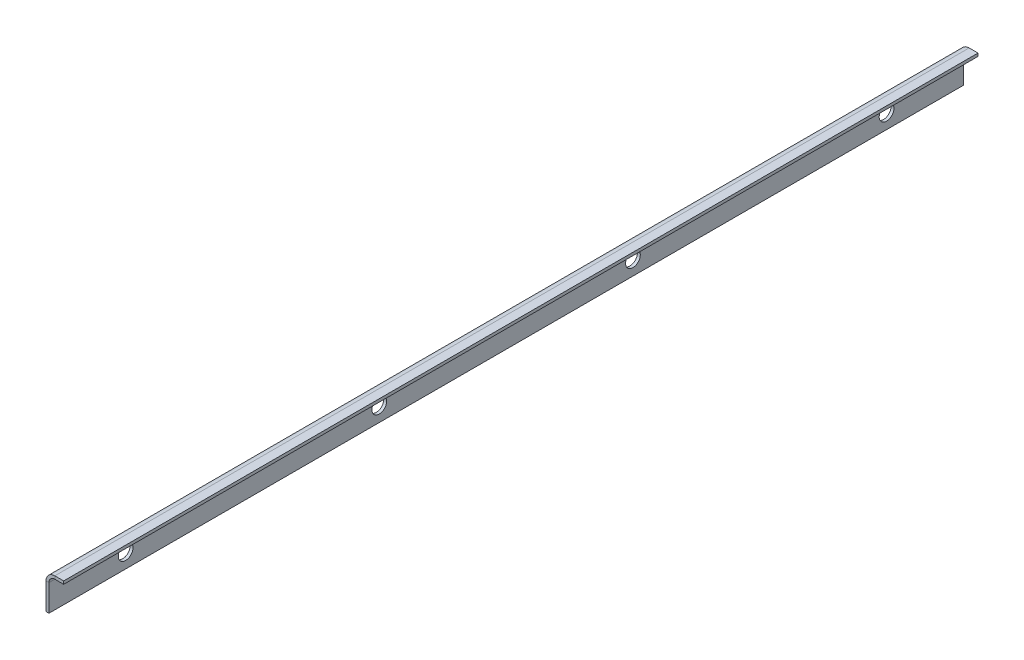
ISO-10303-21;
HEADER;
FILE_DESCRIPTION(('STEP AP214'),'2;1');
FILE_NAME('part.step','',(''),(''),'','','');
FILE_SCHEMA(('AUTOMOTIVE_DESIGN { 1 0 10303 214 1 1 1 1 }'));
ENDSEC;
DATA;
#1=APPLICATION_CONTEXT('core data for automotive mechanical design processes');
#2=APPLICATION_PROTOCOL_DEFINITION('international standard','automotive_design',2000,#1);
#3=PRODUCT_CONTEXT('',#1,'mechanical');
#4=PRODUCT('Part','Part','',(#3));
#5=PRODUCT_RELATED_PRODUCT_CATEGORY('part','',(#4));
#6=PRODUCT_DEFINITION_FORMATION('','',#4);
#7=PRODUCT_DEFINITION_CONTEXT('part definition',#1,'design');
#8=PRODUCT_DEFINITION('design','',#6,#7);
#9=PRODUCT_DEFINITION_SHAPE('','',#8);
#10=(LENGTH_UNIT() NAMED_UNIT(*) SI_UNIT(.MILLI.,.METRE.));
#11=(NAMED_UNIT(*) PLANE_ANGLE_UNIT() SI_UNIT($,.RADIAN.));
#12=(NAMED_UNIT(*) SI_UNIT($,.STERADIAN.) SOLID_ANGLE_UNIT());
#13=UNCERTAINTY_MEASURE_WITH_UNIT(LENGTH_MEASURE(1.E-05),#10,'distance_accuracy_value','');
#14=(GEOMETRIC_REPRESENTATION_CONTEXT(3) GLOBAL_UNCERTAINTY_ASSIGNED_CONTEXT((#13)) GLOBAL_UNIT_ASSIGNED_CONTEXT((#10,
#11,#12)) REPRESENTATION_CONTEXT('',''));
#15=CARTESIAN_POINT('',(0.,0.,0.));
#16=DIRECTION('',(0.,0.,1.));
#17=DIRECTION('',(1.,0.,0.));
#18=AXIS2_PLACEMENT_3D('',#15,#16,#17);
#19=CARTESIAN_POINT('',(-2.,0.,0.));
#20=DIRECTION('',(0.,0.,1.));
#21=DIRECTION('',(0.,-1.,0.));
#22=AXIS2_PLACEMENT_3D('',#19,#20,#21);
#23=PLANE('',#22);
#24=DIRECTION('',(-1.,0.,0.));
#25=VECTOR('',#24,1.);
#26=CARTESIAN_POINT('',(-2.,9.,0.));
#27=LINE('',#26,#25);
#28=CARTESIAN_POINT('',(-1.,9.,0.));
#29=VERTEX_POINT('',#28);
#30=CARTESIAN_POINT('',(-2.,9.,0.));
#31=VERTEX_POINT('',#30);
#32=EDGE_CURVE('E11',#29,#31,#27,.T.);
#33=ORIENTED_EDGE('',*,*,#32,.F.);
#34=DIRECTION('',(0.,1.,0.));
#35=VECTOR('',#34,1.);
#36=CARTESIAN_POINT('',(-1.,0.,0.));
#37=LINE('',#36,#35);
#38=CARTESIAN_POINT('',(-1.,0.,0.));
#39=VERTEX_POINT('',#38);
#40=EDGE_CURVE('E98',#29,#39,#37,.F.);
#41=ORIENTED_EDGE('',*,*,#40,.T.);
#42=DIRECTION('',(-1.,0.,0.));
#43=VECTOR('',#42,1.);
#44=CARTESIAN_POINT('',(-2.,0.,0.));
#45=LINE('',#44,#43);
#46=CARTESIAN_POINT('',(-2.,0.,0.));
#47=VERTEX_POINT('',#46);
#48=EDGE_CURVE('E58',#39,#47,#45,.T.);
#49=ORIENTED_EDGE('',*,*,#48,.T.);
#50=DIRECTION('',(0.,-1.,0.));
#51=VECTOR('',#50,1.);
#52=CARTESIAN_POINT('',(-2.,0.,0.));
#53=LINE('',#52,#51);
#54=EDGE_CURVE('E101',#31,#47,#53,.T.);
#55=ORIENTED_EDGE('',*,*,#54,.F.);
#56=EDGE_LOOP('',(#33,#41,#49,#55));
#57=FACE_BOUND('',#56,.T.);
#58=ADVANCED_FACE('F47',(#57),#23,.F.);
#59=CARTESIAN_POINT('',(-2.,0.,310.));
#60=DIRECTION('',(0.,-1.,0.));
#61=DIRECTION('',(0.,0.,-1.));
#62=AXIS2_PLACEMENT_3D('',#59,#60,#61);
#63=PLANE('',#62);
#64=ORIENTED_EDGE('',*,*,#48,.F.);
#65=DIRECTION('',(0.,0.,-1.));
#66=VECTOR('',#65,1.);
#67=CARTESIAN_POINT('',(-1.,0.,310.));
#68=LINE('',#67,#66);
#69=CARTESIAN_POINT('',(-1.,0.,310.));
#70=VERTEX_POINT('',#69);
#71=EDGE_CURVE('E127',#70,#39,#68,.T.);
#72=ORIENTED_EDGE('',*,*,#71,.F.);
#73=DIRECTION('',(-1.,0.,0.));
#74=VECTOR('',#73,1.);
#75=CARTESIAN_POINT('',(-2.,0.,310.));
#76=LINE('',#75,#74);
#77=CARTESIAN_POINT('',(-2.,0.,310.));
#78=VERTEX_POINT('',#77);
#79=EDGE_CURVE('E169',#70,#78,#76,.T.);
#80=ORIENTED_EDGE('',*,*,#79,.T.);
#81=DIRECTION('',(0.,0.,-1.));
#82=VECTOR('',#81,1.);
#83=CARTESIAN_POINT('',(-2.,0.,310.));
#84=LINE('',#83,#82);
#85=EDGE_CURVE('E182',#78,#47,#84,.T.);
#86=ORIENTED_EDGE('',*,*,#85,.T.);
#87=EDGE_LOOP('',(#64,#72,#80,#86));
#88=FACE_BOUND('',#87,.T.);
#89=ADVANCED_FACE('F189',(#88),#63,.T.);
#90=CARTESIAN_POINT('',(-2.,0.,310.));
#91=DIRECTION('',(0.,0.,1.));
#92=DIRECTION('',(0.,-1.,0.));
#93=AXIS2_PLACEMENT_3D('',#90,#91,#92);
#94=PLANE('',#93);
#95=ORIENTED_EDGE('',*,*,#79,.F.);
#96=DIRECTION('',(0.,1.,0.));
#97=VECTOR('',#96,1.);
#98=CARTESIAN_POINT('',(-1.,0.,310.));
#99=LINE('',#98,#97);
#100=CARTESIAN_POINT('',(-1.,9.,310.));
#101=VERTEX_POINT('',#100);
#102=EDGE_CURVE('E228',#101,#70,#99,.F.);
#103=ORIENTED_EDGE('',*,*,#102,.F.);
#104=DIRECTION('',(-1.,0.,0.));
#105=VECTOR('',#104,1.);
#106=CARTESIAN_POINT('',(-2.,9.,310.));
#107=LINE('',#106,#105);
#108=CARTESIAN_POINT('',(-2.,9.,310.));
#109=VERTEX_POINT('',#108);
#110=EDGE_CURVE('E165',#101,#109,#107,.T.);
#111=ORIENTED_EDGE('',*,*,#110,.T.);
#112=DIRECTION('',(0.,-1.,0.));
#113=VECTOR('',#112,1.);
#114=CARTESIAN_POINT('',(-2.,0.,310.));
#115=LINE('',#114,#113);
#116=EDGE_CURVE('E191',#109,#78,#115,.T.);
#117=ORIENTED_EDGE('',*,*,#116,.T.);
#118=EDGE_LOOP('',(#95,#103,#111,#117));
#119=FACE_BOUND('',#118,.T.);
#120=ADVANCED_FACE('F277',(#119),#94,.T.);
#121=CARTESIAN_POINT('',(1.,9.,310.));
#122=DIRECTION('',(0.,0.,-1.));
#123=DIRECTION('',(-1.,0.,0.));
#124=AXIS2_PLACEMENT_3D('',#121,#122,#123);
#125=PLANE('',#124);
#126=ORIENTED_EDGE('',*,*,#110,.F.);
#127=CARTESIAN_POINT('',(1.,9.,310.));
#128=DIRECTION('',(0.,0.,-1.));
#129=DIRECTION('',(-1.,0.,0.));
#130=AXIS2_PLACEMENT_3D('',#127,#128,#129);
#131=CIRCLE('',#130,2.);
#132=CARTESIAN_POINT('',(1.,11.,310.));
#133=VERTEX_POINT('',#132);
#134=EDGE_CURVE('E116',#101,#133,#131,.T.);
#135=ORIENTED_EDGE('',*,*,#134,.T.);
#136=DIRECTION('',(0.,1.,0.));
#137=VECTOR('',#136,1.);
#138=CARTESIAN_POINT('',(1.,12.,310.));
#139=LINE('',#138,#137);
#140=CARTESIAN_POINT('',(1.,12.,310.));
#141=VERTEX_POINT('',#140);
#142=EDGE_CURVE('E66',#133,#141,#139,.T.);
#143=ORIENTED_EDGE('',*,*,#142,.T.);
#144=CARTESIAN_POINT('',(1.,9.,310.));
#145=DIRECTION('',(0.,0.,1.));
#146=DIRECTION('',(1.,0.,0.));
#147=AXIS2_PLACEMENT_3D('',#144,#145,#146);
#148=CIRCLE('',#147,3.);
#149=EDGE_CURVE('E218',#109,#141,#148,.F.);
#150=ORIENTED_EDGE('',*,*,#149,.F.);
#151=EDGE_LOOP('',(#126,#135,#143,#150));
#152=FACE_BOUND('',#151,.T.);
#153=ADVANCED_FACE('F336',(#152),#125,.F.);
#154=CARTESIAN_POINT('',(-2.,12.,310.));
#155=DIRECTION('',(0.,0.,1.));
#156=DIRECTION('',(-1.,0.,0.));
#157=AXIS2_PLACEMENT_3D('',#154,#155,#156);
#158=PLANE('',#157);
#159=ORIENTED_EDGE('',*,*,#142,.F.);
#160=DIRECTION('',(1.,0.,0.));
#161=VECTOR('',#160,1.);
#162=CARTESIAN_POINT('',(-2.,11.,310.));
#163=LINE('',#162,#161);
#164=CARTESIAN_POINT('',(4.,11.,310.));
#165=VERTEX_POINT('',#164);
#166=EDGE_CURVE('E227',#165,#133,#163,.F.);
#167=ORIENTED_EDGE('',*,*,#166,.F.);
#168=DIRECTION('',(0.,1.,0.));
#169=VECTOR('',#168,1.);
#170=CARTESIAN_POINT('',(4.,12.,310.));
#171=LINE('',#170,#169);
#172=CARTESIAN_POINT('',(4.,12.,310.));
#173=VERTEX_POINT('',#172);
#174=EDGE_CURVE('E159',#165,#173,#171,.T.);
#175=ORIENTED_EDGE('',*,*,#174,.T.);
#176=DIRECTION('',(-1.,0.,0.));
#177=VECTOR('',#176,1.);
#178=CARTESIAN_POINT('',(-2.,12.,310.));
#179=LINE('',#178,#177);
#180=EDGE_CURVE('E201',#173,#141,#179,.T.);
#181=ORIENTED_EDGE('',*,*,#180,.T.);
#182=EDGE_LOOP('',(#159,#167,#175,#181));
#183=FACE_BOUND('',#182,.T.);
#184=ADVANCED_FACE('F327',(#183),#158,.T.);
#185=CARTESIAN_POINT('',(4.,12.,310.));
#186=DIRECTION('',(-1.,0.,0.));
#187=DIRECTION('',(0.,0.,-1.));
#188=AXIS2_PLACEMENT_3D('',#185,#186,#187);
#189=PLANE('',#188);
#190=ORIENTED_EDGE('',*,*,#174,.F.);
#191=DIRECTION('',(0.,0.,-1.));
#192=VECTOR('',#191,1.);
#193=CARTESIAN_POINT('',(4.,11.,310.));
#194=LINE('',#193,#192);
#195=CARTESIAN_POINT('',(4.,11.,0.));
#196=VERTEX_POINT('',#195);
#197=EDGE_CURVE('E122',#165,#196,#194,.T.);
#198=ORIENTED_EDGE('',*,*,#197,.T.);
#199=DIRECTION('',(0.,1.,0.));
#200=VECTOR('',#199,1.);
#201=CARTESIAN_POINT('',(4.,12.,0.));
#202=LINE('',#201,#200);
#203=CARTESIAN_POINT('',(4.,12.,0.));
#204=VERTEX_POINT('',#203);
#205=EDGE_CURVE('E155',#196,#204,#202,.T.);
#206=ORIENTED_EDGE('',*,*,#205,.T.);
#207=DIRECTION('',(0.,0.,-1.));
#208=VECTOR('',#207,1.);
#209=CARTESIAN_POINT('',(4.,12.,310.));
#210=LINE('',#209,#208);
#211=EDGE_CURVE('E205',#173,#204,#210,.T.);
#212=ORIENTED_EDGE('',*,*,#211,.F.);
#213=EDGE_LOOP('',(#190,#198,#206,#212));
#214=FACE_BOUND('',#213,.T.);
#215=ADVANCED_FACE('F332',(#214),#189,.F.);
#216=CARTESIAN_POINT('',(-2.,12.,0.));
#217=DIRECTION('',(0.,0.,1.));
#218=DIRECTION('',(-1.,0.,0.));
#219=AXIS2_PLACEMENT_3D('',#216,#217,#218);
#220=PLANE('',#219);
#221=ORIENTED_EDGE('',*,*,#205,.F.);
#222=DIRECTION('',(1.,0.,0.));
#223=VECTOR('',#222,1.);
#224=CARTESIAN_POINT('',(-2.,11.,0.));
#225=LINE('',#224,#223);
#226=CARTESIAN_POINT('',(1.,11.,0.));
#227=VERTEX_POINT('',#226);
#228=EDGE_CURVE('E224',#196,#227,#225,.F.);
#229=ORIENTED_EDGE('',*,*,#228,.T.);
#230=DIRECTION('',(0.,1.,0.));
#231=VECTOR('',#230,1.);
#232=CARTESIAN_POINT('',(1.,12.,0.));
#233=LINE('',#232,#231);
#234=CARTESIAN_POINT('',(1.,12.,0.));
#235=VERTEX_POINT('',#234);
#236=EDGE_CURVE('E51',#227,#235,#233,.T.);
#237=ORIENTED_EDGE('',*,*,#236,.T.);
#238=DIRECTION('',(-1.,0.,0.));
#239=VECTOR('',#238,1.);
#240=CARTESIAN_POINT('',(-2.,12.,0.));
#241=LINE('',#240,#239);
#242=EDGE_CURVE('E194',#204,#235,#241,.T.);
#243=ORIENTED_EDGE('',*,*,#242,.F.);
#244=EDGE_LOOP('',(#221,#229,#237,#243));
#245=FACE_BOUND('',#244,.T.);
#246=ADVANCED_FACE('F288',(#245),#220,.F.);
#247=CARTESIAN_POINT('',(-2.,5.,284.));
#248=DIRECTION('',(1.,0.,0.));
#249=DIRECTION('',(0.,0.,-1.));
#250=AXIS2_PLACEMENT_3D('',#247,#248,#249);
#251=CYLINDRICAL_SURFACE('',#250,2.50000000000002);
#252=CARTESIAN_POINT('',(-2.,5.,284.));
#253=DIRECTION('',(1.,0.,0.));
#254=DIRECTION('',(0.,0.,-1.));
#255=AXIS2_PLACEMENT_3D('',#252,#253,#254);
#256=CIRCLE('',#255,2.50000000000002);
#257=CARTESIAN_POINT('',(-2.,5.,281.5));
#258=VERTEX_POINT('',#257);
#259=EDGE_CURVE('E221',#258,#258,#256,.T.);
#260=ORIENTED_EDGE('',*,*,#259,.F.);
#261=EDGE_LOOP('',(#260));
#262=FACE_BOUND('',#261,.T.);
#263=CARTESIAN_POINT('',(-1.,5.,284.));
#264=DIRECTION('',(1.,0.,0.));
#265=DIRECTION('',(0.,0.,-1.));
#266=AXIS2_PLACEMENT_3D('',#263,#264,#265);
#267=CIRCLE('',#266,2.50000000000002);
#268=CARTESIAN_POINT('',(-1.,5.,281.5));
#269=VERTEX_POINT('',#268);
#270=EDGE_CURVE('E137',#269,#269,#267,.T.);
#271=ORIENTED_EDGE('',*,*,#270,.T.);
#272=EDGE_LOOP('',(#271));
#273=FACE_BOUND('',#272,.T.);
#274=ADVANCED_FACE('F284',(#262,#273),#251,.F.);
#275=CARTESIAN_POINT('',(-2.,5.,198.));
#276=DIRECTION('',(1.,0.,0.));
#277=DIRECTION('',(0.,0.,-1.));
#278=AXIS2_PLACEMENT_3D('',#275,#276,#277);
#279=CYLINDRICAL_SURFACE('',#278,2.5);
#280=CARTESIAN_POINT('',(-2.,5.,198.));
#281=DIRECTION('',(1.,0.,0.));
#282=DIRECTION('',(0.,0.,-1.));
#283=AXIS2_PLACEMENT_3D('',#280,#281,#282);
#284=CIRCLE('',#283,2.5);
#285=CARTESIAN_POINT('',(-2.,5.,195.5));
#286=VERTEX_POINT('',#285);
#287=EDGE_CURVE('E240',#286,#286,#284,.T.);
#288=ORIENTED_EDGE('',*,*,#287,.F.);
#289=EDGE_LOOP('',(#288));
#290=FACE_BOUND('',#289,.T.);
#291=CARTESIAN_POINT('',(-1.,5.,198.));
#292=DIRECTION('',(1.,0.,0.));
#293=DIRECTION('',(0.,0.,-1.));
#294=AXIS2_PLACEMENT_3D('',#291,#292,#293);
#295=CIRCLE('',#294,2.5);
#296=CARTESIAN_POINT('',(-1.,5.,195.5));
#297=VERTEX_POINT('',#296);
#298=EDGE_CURVE('E144',#297,#297,#295,.T.);
#299=ORIENTED_EDGE('',*,*,#298,.T.);
#300=EDGE_LOOP('',(#299));
#301=FACE_BOUND('',#300,.T.);
#302=ADVANCED_FACE('F287',(#290,#301),#279,.F.);
#303=CARTESIAN_POINT('',(-2.,5.,112.));
#304=DIRECTION('',(1.,0.,0.));
#305=DIRECTION('',(0.,0.,-1.));
#306=AXIS2_PLACEMENT_3D('',#303,#304,#305);
#307=CYLINDRICAL_SURFACE('',#306,2.49999999999999);
#308=CARTESIAN_POINT('',(-2.,5.,112.));
#309=DIRECTION('',(1.,0.,0.));
#310=DIRECTION('',(0.,0.,-1.));
#311=AXIS2_PLACEMENT_3D('',#308,#309,#310);
#312=CIRCLE('',#311,2.49999999999999);
#313=CARTESIAN_POINT('',(-2.,5.,109.5));
#314=VERTEX_POINT('',#313);
#315=EDGE_CURVE('E244',#314,#314,#312,.T.);
#316=ORIENTED_EDGE('',*,*,#315,.F.);
#317=EDGE_LOOP('',(#316));
#318=FACE_BOUND('',#317,.T.);
#319=CARTESIAN_POINT('',(-1.,5.,112.));
#320=DIRECTION('',(1.,0.,0.));
#321=DIRECTION('',(0.,0.,-1.));
#322=AXIS2_PLACEMENT_3D('',#319,#320,#321);
#323=CIRCLE('',#322,2.49999999999999);
#324=CARTESIAN_POINT('',(-1.,5.,109.5));
#325=VERTEX_POINT('',#324);
#326=EDGE_CURVE('E148',#325,#325,#323,.T.);
#327=ORIENTED_EDGE('',*,*,#326,.T.);
#328=EDGE_LOOP('',(#327));
#329=FACE_BOUND('',#328,.T.);
#330=ADVANCED_FACE('F255',(#318,#329),#307,.F.);
#331=CARTESIAN_POINT('',(-2.,5.,26.));
#332=DIRECTION('',(1.,0.,0.));
#333=DIRECTION('',(0.,0.,-1.));
#334=AXIS2_PLACEMENT_3D('',#331,#332,#333);
#335=CYLINDRICAL_SURFACE('',#334,2.5);
#336=CARTESIAN_POINT('',(-2.,5.,26.));
#337=DIRECTION('',(1.,0.,0.));
#338=DIRECTION('',(0.,0.,-1.));
#339=AXIS2_PLACEMENT_3D('',#336,#337,#338);
#340=CIRCLE('',#339,2.5);
#341=CARTESIAN_POINT('',(-2.,5.,23.5));
#342=VERTEX_POINT('',#341);
#343=EDGE_CURVE('E187',#342,#342,#340,.T.);
#344=ORIENTED_EDGE('',*,*,#343,.F.);
#345=EDGE_LOOP('',(#344));
#346=FACE_BOUND('',#345,.T.);
#347=CARTESIAN_POINT('',(-1.,5.,26.));
#348=DIRECTION('',(1.,0.,0.));
#349=DIRECTION('',(0.,0.,-1.));
#350=AXIS2_PLACEMENT_3D('',#347,#348,#349);
#351=CIRCLE('',#350,2.5);
#352=CARTESIAN_POINT('',(-1.,5.,23.5));
#353=VERTEX_POINT('',#352);
#354=EDGE_CURVE('E129',#353,#353,#351,.T.);
#355=ORIENTED_EDGE('',*,*,#354,.T.);
#356=EDGE_LOOP('',(#355));
#357=FACE_BOUND('',#356,.T.);
#358=ADVANCED_FACE('F49',(#346,#357),#335,.F.);
#359=CARTESIAN_POINT('',(1.,9.,0.));
#360=DIRECTION('',(0.,0.,1.));
#361=DIRECTION('',(1.,0.,0.));
#362=AXIS2_PLACEMENT_3D('',#359,#360,#361);
#363=PLANE('',#362);
#364=CARTESIAN_POINT('',(1.,9.,0.));
#365=DIRECTION('',(0.,0.,-1.));
#366=DIRECTION('',(-1.,0.,0.));
#367=AXIS2_PLACEMENT_3D('',#364,#365,#366);
#368=CIRCLE('',#367,2.);
#369=EDGE_CURVE('E114',#227,#29,#368,.F.);
#370=ORIENTED_EDGE('',*,*,#369,.T.);
#371=ORIENTED_EDGE('',*,*,#32,.T.);
#372=CARTESIAN_POINT('',(1.,9.,0.));
#373=DIRECTION('',(0.,0.,-1.));
#374=DIRECTION('',(-1.,0.,0.));
#375=AXIS2_PLACEMENT_3D('',#372,#373,#374);
#376=CIRCLE('',#375,3.);
#377=EDGE_CURVE('E215',#235,#31,#376,.F.);
#378=ORIENTED_EDGE('',*,*,#377,.F.);
#379=ORIENTED_EDGE('',*,*,#236,.F.);
#380=EDGE_LOOP('',(#370,#371,#378,#379));
#381=FACE_BOUND('',#380,.T.);
#382=ADVANCED_FACE('F132',(#381),#363,.F.);
#383=CARTESIAN_POINT('',(-2.,12.,310.));
#384=DIRECTION('',(0.,-1.,0.));
#385=DIRECTION('',(0.,0.,-1.));
#386=AXIS2_PLACEMENT_3D('',#383,#384,#385);
#387=PLANE('',#386);
#388=ORIENTED_EDGE('',*,*,#242,.T.);
#389=DIRECTION('',(0.,0.,-1.));
#390=VECTOR('',#389,1.);
#391=CARTESIAN_POINT('',(1.,12.,310.));
#392=LINE('',#391,#390);
#393=EDGE_CURVE('E211',#235,#141,#392,.F.);
#394=ORIENTED_EDGE('',*,*,#393,.T.);
#395=ORIENTED_EDGE('',*,*,#180,.F.);
#396=ORIENTED_EDGE('',*,*,#211,.T.);
#397=EDGE_LOOP('',(#388,#394,#395,#396));
#398=FACE_BOUND('',#397,.T.);
#399=ADVANCED_FACE('F283',(#398),#387,.F.);
#400=CARTESIAN_POINT('',(-2.,0.,310.));
#401=DIRECTION('',(1.,0.,0.));
#402=DIRECTION('',(0.,0.,-1.));
#403=AXIS2_PLACEMENT_3D('',#400,#401,#402);
#404=PLANE('',#403);
#405=ORIENTED_EDGE('',*,*,#259,.T.);
#406=EDGE_LOOP('',(#405));
#407=FACE_BOUND('',#406,.T.);
#408=ORIENTED_EDGE('',*,*,#287,.T.);
#409=EDGE_LOOP('',(#408));
#410=FACE_BOUND('',#409,.T.);
#411=ORIENTED_EDGE('',*,*,#315,.T.);
#412=EDGE_LOOP('',(#411));
#413=FACE_BOUND('',#412,.T.);
#414=ORIENTED_EDGE('',*,*,#343,.T.);
#415=EDGE_LOOP('',(#414));
#416=FACE_BOUND('',#415,.T.);
#417=ORIENTED_EDGE('',*,*,#116,.F.);
#418=DIRECTION('',(0.,0.,-1.));
#419=VECTOR('',#418,1.);
#420=CARTESIAN_POINT('',(-2.,9.,310.));
#421=LINE('',#420,#419);
#422=EDGE_CURVE('E185',#109,#31,#421,.T.);
#423=ORIENTED_EDGE('',*,*,#422,.T.);
#424=ORIENTED_EDGE('',*,*,#54,.T.);
#425=ORIENTED_EDGE('',*,*,#85,.F.);
#426=EDGE_LOOP('',(#417,#423,#424,#425));
#427=FACE_BOUND('',#426,.T.);
#428=ADVANCED_FACE('F181',(#407,#410,#413,#416,#427),#404,.F.);
#429=CARTESIAN_POINT('',(1.,9.,310.));
#430=DIRECTION('',(0.,0.,-1.));
#431=DIRECTION('',(-1.,0.,0.));
#432=AXIS2_PLACEMENT_3D('',#429,#430,#431);
#433=CYLINDRICAL_SURFACE('',#432,3.);
#434=ORIENTED_EDGE('',*,*,#149,.T.);
#435=ORIENTED_EDGE('',*,*,#393,.F.);
#436=ORIENTED_EDGE('',*,*,#377,.T.);
#437=ORIENTED_EDGE('',*,*,#422,.F.);
#438=EDGE_LOOP('',(#434,#435,#436,#437));
#439=FACE_BOUND('',#438,.T.);
#440=ADVANCED_FACE('F267',(#439),#433,.T.);
#441=CARTESIAN_POINT('',(-2.,11.,310.));
#442=DIRECTION('',(0.,-1.,0.));
#443=DIRECTION('',(0.,0.,-1.));
#444=AXIS2_PLACEMENT_3D('',#441,#442,#443);
#445=PLANE('',#444);
#446=ORIENTED_EDGE('',*,*,#228,.F.);
#447=ORIENTED_EDGE('',*,*,#197,.F.);
#448=ORIENTED_EDGE('',*,*,#166,.T.);
#449=DIRECTION('',(0.,0.,-1.));
#450=VECTOR('',#449,1.);
#451=CARTESIAN_POINT('',(1.,11.,310.));
#452=LINE('',#451,#450);
#453=EDGE_CURVE('E121',#227,#133,#452,.F.);
#454=ORIENTED_EDGE('',*,*,#453,.F.);
#455=EDGE_LOOP('',(#446,#447,#448,#454));
#456=FACE_BOUND('',#455,.T.);
#457=ADVANCED_FACE('F259',(#456),#445,.T.);
#458=CARTESIAN_POINT('',(-1.,0.,310.));
#459=DIRECTION('',(1.,0.,0.));
#460=DIRECTION('',(0.,0.,-1.));
#461=AXIS2_PLACEMENT_3D('',#458,#459,#460);
#462=PLANE('',#461);
#463=ORIENTED_EDGE('',*,*,#270,.F.);
#464=EDGE_LOOP('',(#463));
#465=FACE_BOUND('',#464,.T.);
#466=ORIENTED_EDGE('',*,*,#298,.F.);
#467=EDGE_LOOP('',(#466));
#468=FACE_BOUND('',#467,.T.);
#469=ORIENTED_EDGE('',*,*,#326,.F.);
#470=EDGE_LOOP('',(#469));
#471=FACE_BOUND('',#470,.T.);
#472=ORIENTED_EDGE('',*,*,#354,.F.);
#473=EDGE_LOOP('',(#472));
#474=FACE_BOUND('',#473,.T.);
#475=ORIENTED_EDGE('',*,*,#102,.T.);
#476=ORIENTED_EDGE('',*,*,#71,.T.);
#477=ORIENTED_EDGE('',*,*,#40,.F.);
#478=DIRECTION('',(0.,0.,-1.));
#479=VECTOR('',#478,1.);
#480=CARTESIAN_POINT('',(-1.,9.,310.));
#481=LINE('',#480,#479);
#482=EDGE_CURVE('E111',#101,#29,#481,.T.);
#483=ORIENTED_EDGE('',*,*,#482,.F.);
#484=EDGE_LOOP('',(#475,#476,#477,#483));
#485=FACE_BOUND('',#484,.T.);
#486=ADVANCED_FACE('F125',(#465,#468,#471,#474,#485),#462,.T.);
#487=CARTESIAN_POINT('',(1.,9.,310.));
#488=DIRECTION('',(0.,0.,-1.));
#489=DIRECTION('',(-1.,0.,0.));
#490=AXIS2_PLACEMENT_3D('',#487,#488,#489);
#491=CYLINDRICAL_SURFACE('',#490,2.);
#492=ORIENTED_EDGE('',*,*,#134,.F.);
#493=ORIENTED_EDGE('',*,*,#482,.T.);
#494=ORIENTED_EDGE('',*,*,#369,.F.);
#495=ORIENTED_EDGE('',*,*,#453,.T.);
#496=EDGE_LOOP('',(#492,#493,#494,#495));
#497=FACE_BOUND('',#496,.T.);
#498=ADVANCED_FACE('F112',(#497),#491,.F.);
#499=CLOSED_SHELL('',(#58,#89,#120,#153,#184,#215,#246,#274,#302,#330,#358,#382,#399,#428,#440,
#457,#486,#498));
#500=MANIFOLD_SOLID_BREP('B2',#499);
#501=ADVANCED_BREP_SHAPE_REPRESENTATION('',(#18,#500),#14);
#502=SHAPE_DEFINITION_REPRESENTATION(#9,#501);
ENDSEC;
END-ISO-10303-21;
